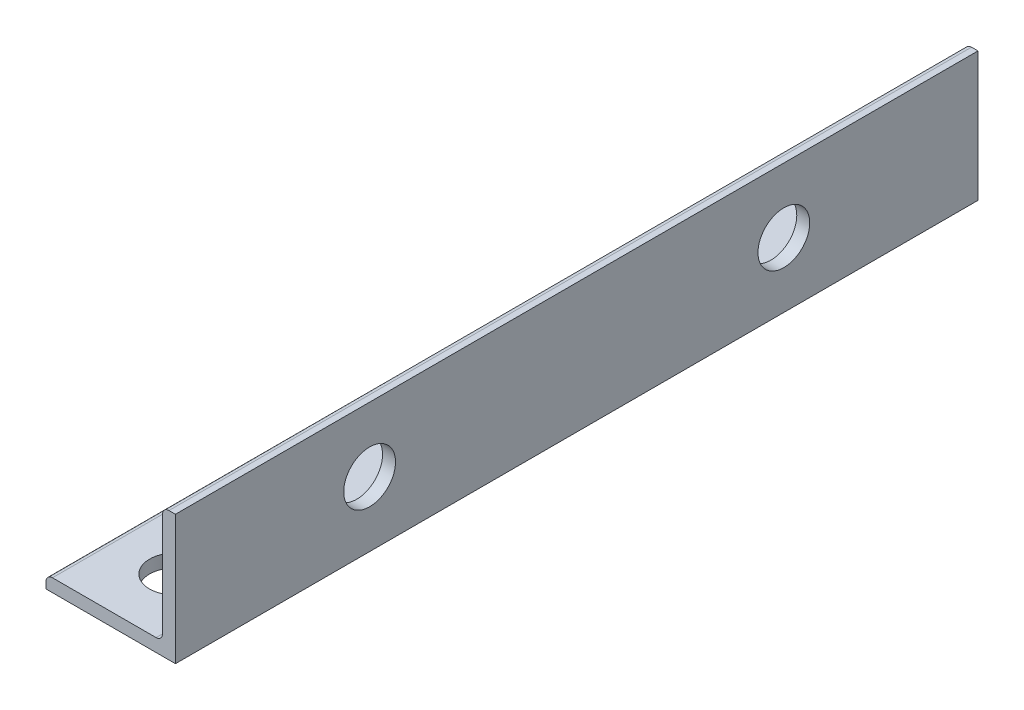
ISO-10303-21;
HEADER;
FILE_DESCRIPTION(('STEP AP214'),'2;1');
FILE_NAME('part.step','',(''),(''),'','','');
FILE_SCHEMA(('AUTOMOTIVE_DESIGN { 1 0 10303 214 1 1 1 1 }'));
ENDSEC;
DATA;
#1=APPLICATION_CONTEXT('core data for automotive mechanical design processes');
#2=APPLICATION_PROTOCOL_DEFINITION('international standard','automotive_design',2000,#1);
#3=PRODUCT_CONTEXT('',#1,'mechanical');
#4=PRODUCT('Part','Part','',(#3));
#5=PRODUCT_RELATED_PRODUCT_CATEGORY('part','',(#4));
#6=PRODUCT_DEFINITION_FORMATION('','',#4);
#7=PRODUCT_DEFINITION_CONTEXT('part definition',#1,'design');
#8=PRODUCT_DEFINITION('design','',#6,#7);
#9=PRODUCT_DEFINITION_SHAPE('','',#8);
#10=(LENGTH_UNIT() NAMED_UNIT(*) SI_UNIT(.MILLI.,.METRE.));
#11=(NAMED_UNIT(*) PLANE_ANGLE_UNIT() SI_UNIT($,.RADIAN.));
#12=(NAMED_UNIT(*) SI_UNIT($,.STERADIAN.) SOLID_ANGLE_UNIT());
#13=UNCERTAINTY_MEASURE_WITH_UNIT(LENGTH_MEASURE(1.E-05),#10,'distance_accuracy_value','');
#14=(GEOMETRIC_REPRESENTATION_CONTEXT(3) GLOBAL_UNCERTAINTY_ASSIGNED_CONTEXT((#13)) GLOBAL_UNIT_ASSIGNED_CONTEXT((#10,
#11,#12)) REPRESENTATION_CONTEXT('',''));
#15=CARTESIAN_POINT('',(0.,0.,0.));
#16=DIRECTION('',(0.,0.,1.));
#17=DIRECTION('',(1.,0.,0.));
#18=AXIS2_PLACEMENT_3D('',#15,#16,#17);
#19=CARTESIAN_POINT('',(-7.9375,0.793749999999998,49.2125));
#20=DIRECTION('',(1.,0.,0.));
#21=DIRECTION('',(0.,0.,-1.));
#22=AXIS2_PLACEMENT_3D('',#19,#20,#21);
#23=PLANE('',#22);
#24=DIRECTION('',(0.,-1.,0.));
#25=VECTOR('',#24,1.);
#26=CARTESIAN_POINT('',(-7.9375,0.793749999999998,-49.2125));
#27=LINE('',#26,#25);
#28=CARTESIAN_POINT('',(-7.9375,0.793749999999999,-49.2125));
#29=VERTEX_POINT('',#28);
#30=CARTESIAN_POINT('',(-7.9375,0.,-49.2125));
#31=VERTEX_POINT('',#30);
#32=EDGE_CURVE('E142',#29,#31,#27,.T.);
#33=ORIENTED_EDGE('',*,*,#32,.T.);
#34=DIRECTION('',(0.,0.,-1.));
#35=VECTOR('',#34,1.);
#36=CARTESIAN_POINT('',(-7.9375,0.,49.2125));
#37=LINE('',#36,#35);
#38=CARTESIAN_POINT('',(-7.9375,0.,49.2125));
#39=VERTEX_POINT('',#38);
#40=EDGE_CURVE('E11',#39,#31,#37,.T.);
#41=ORIENTED_EDGE('',*,*,#40,.F.);
#42=DIRECTION('',(0.,-1.,0.));
#43=VECTOR('',#42,1.);
#44=CARTESIAN_POINT('',(-7.9375,0.793749999999998,49.2125));
#45=LINE('',#44,#43);
#46=CARTESIAN_POINT('',(-7.9375,0.793749999999999,49.2125));
#47=VERTEX_POINT('',#46);
#48=EDGE_CURVE('E158',#47,#39,#45,.T.);
#49=ORIENTED_EDGE('',*,*,#48,.F.);
#50=DIRECTION('',(0.,0.,-1.));
#51=VECTOR('',#50,1.);
#52=CARTESIAN_POINT('',(-7.9375,0.793749999999999,49.2125));
#53=LINE('',#52,#51);
#54=EDGE_CURVE('E138',#47,#29,#53,.T.);
#55=ORIENTED_EDGE('',*,*,#54,.T.);
#56=EDGE_LOOP('',(#33,#41,#49,#55));
#57=FACE_BOUND('',#56,.T.);
#58=ADVANCED_FACE('F38',(#57),#23,.F.);
#59=CARTESIAN_POINT('',(-7.9375,0.,49.2125));
#60=DIRECTION('',(0.,1.,0.));
#61=DIRECTION('',(0.,0.,1.));
#62=AXIS2_PLACEMENT_3D('',#59,#60,#61);
#63=PLANE('',#62);
#64=CARTESIAN_POINT('',(0.,0.,-41.275));
#65=DIRECTION('',(0.,-1.,0.));
#66=DIRECTION('',(0.,0.,-1.));
#67=AXIS2_PLACEMENT_3D('',#64,#65,#66);
#68=CIRCLE('',#67,3.175);
#69=CARTESIAN_POINT('',(0.,0.,-44.45));
#70=VERTEX_POINT('',#69);
#71=EDGE_CURVE('E361',#70,#70,#68,.T.);
#72=ORIENTED_EDGE('',*,*,#71,.F.);
#73=EDGE_LOOP('',(#72));
#74=FACE_BOUND('',#73,.T.);
#75=CARTESIAN_POINT('',(0.,0.,41.275));
#76=DIRECTION('',(0.,-1.,0.));
#77=DIRECTION('',(0.,0.,-1.));
#78=AXIS2_PLACEMENT_3D('',#75,#76,#77);
#79=CIRCLE('',#78,3.175);
#80=CARTESIAN_POINT('',(0.,0.,38.1));
#81=VERTEX_POINT('',#80);
#82=EDGE_CURVE('E366',#81,#81,#79,.T.);
#83=ORIENTED_EDGE('',*,*,#82,.F.);
#84=EDGE_LOOP('',(#83));
#85=FACE_BOUND('',#84,.T.);
#86=DIRECTION('',(1.,0.,0.));
#87=VECTOR('',#86,1.);
#88=CARTESIAN_POINT('',(-7.9375,0.,-49.2125));
#89=LINE('',#88,#87);
#90=CARTESIAN_POINT('',(7.9375,0.,-49.2125));
#91=VERTEX_POINT('',#90);
#92=EDGE_CURVE('E145',#31,#91,#89,.T.);
#93=ORIENTED_EDGE('',*,*,#92,.T.);
#94=DIRECTION('',(0.,0.,-1.));
#95=VECTOR('',#94,1.);
#96=CARTESIAN_POINT('',(7.9375,0.,49.2125));
#97=LINE('',#96,#95);
#98=CARTESIAN_POINT('',(7.9375,0.,49.2125));
#99=VERTEX_POINT('',#98);
#100=EDGE_CURVE('E47',#99,#91,#97,.T.);
#101=ORIENTED_EDGE('',*,*,#100,.F.);
#102=DIRECTION('',(1.,0.,0.));
#103=VECTOR('',#102,1.);
#104=CARTESIAN_POINT('',(-7.9375,0.,49.2125));
#105=LINE('',#104,#103);
#106=EDGE_CURVE('E102',#39,#99,#105,.T.);
#107=ORIENTED_EDGE('',*,*,#106,.F.);
#108=ORIENTED_EDGE('',*,*,#40,.T.);
#109=EDGE_LOOP('',(#93,#101,#107,#108));
#110=FACE_BOUND('',#109,.T.);
#111=ADVANCED_FACE('F226',(#74,#85,#110),#63,.F.);
#112=CARTESIAN_POINT('',(7.9375,0.,49.2125));
#113=DIRECTION('',(-1.,0.,0.));
#114=DIRECTION('',(0.,0.,1.));
#115=AXIS2_PLACEMENT_3D('',#112,#113,#114);
#116=PLANE('',#115);
#117=CARTESIAN_POINT('',(7.9375,7.93749999999999,25.4));
#118=DIRECTION('',(1.,0.,0.));
#119=DIRECTION('',(0.,0.,-1.));
#120=AXIS2_PLACEMENT_3D('',#117,#118,#119);
#121=CIRCLE('',#120,3.175);
#122=CARTESIAN_POINT('',(7.9375,7.93749999999999,22.225));
#123=VERTEX_POINT('',#122);
#124=EDGE_CURVE('E174',#123,#123,#121,.T.);
#125=ORIENTED_EDGE('',*,*,#124,.F.);
#126=EDGE_LOOP('',(#125));
#127=FACE_BOUND('',#126,.T.);
#128=CARTESIAN_POINT('',(7.9375,7.93749999999999,-25.4));
#129=DIRECTION('',(1.,0.,0.));
#130=DIRECTION('',(0.,0.,-1.));
#131=AXIS2_PLACEMENT_3D('',#128,#129,#130);
#132=CIRCLE('',#131,3.175);
#133=CARTESIAN_POINT('',(7.9375,7.93749999999999,-28.575));
#134=VERTEX_POINT('',#133);
#135=EDGE_CURVE('E179',#134,#134,#132,.T.);
#136=ORIENTED_EDGE('',*,*,#135,.F.);
#137=EDGE_LOOP('',(#136));
#138=FACE_BOUND('',#137,.T.);
#139=DIRECTION('',(0.,1.,0.));
#140=VECTOR('',#139,1.);
#141=CARTESIAN_POINT('',(7.9375,0.,-49.2125));
#142=LINE('',#141,#140);
#143=CARTESIAN_POINT('',(7.9375,15.875,-49.2125));
#144=VERTEX_POINT('',#143);
#145=EDGE_CURVE('E147',#91,#144,#142,.T.);
#146=ORIENTED_EDGE('',*,*,#145,.T.);
#147=DIRECTION('',(0.,0.,-1.));
#148=VECTOR('',#147,1.);
#149=CARTESIAN_POINT('',(7.9375,15.875,49.2125));
#150=LINE('',#149,#148);
#151=CARTESIAN_POINT('',(7.9375,15.875,49.2125));
#152=VERTEX_POINT('',#151);
#153=EDGE_CURVE('E168',#152,#144,#150,.T.);
#154=ORIENTED_EDGE('',*,*,#153,.F.);
#155=DIRECTION('',(0.,1.,0.));
#156=VECTOR('',#155,1.);
#157=CARTESIAN_POINT('',(7.9375,0.,49.2125));
#158=LINE('',#157,#156);
#159=EDGE_CURVE('E192',#99,#152,#158,.T.);
#160=ORIENTED_EDGE('',*,*,#159,.F.);
#161=ORIENTED_EDGE('',*,*,#100,.T.);
#162=EDGE_LOOP('',(#146,#154,#160,#161));
#163=FACE_BOUND('',#162,.T.);
#164=ADVANCED_FACE('F230',(#127,#138,#163),#116,.F.);
#165=CARTESIAN_POINT('',(7.14375,15.875,49.2125));
#166=DIRECTION('',(0.,-1.,0.));
#167=DIRECTION('',(1.,0.,0.));
#168=AXIS2_PLACEMENT_3D('',#165,#166,#167);
#169=PLANE('',#168);
#170=DIRECTION('',(-1.,0.,0.));
#171=VECTOR('',#170,1.);
#172=CARTESIAN_POINT('',(7.14375,15.875,-49.2125));
#173=LINE('',#172,#171);
#174=CARTESIAN_POINT('',(7.14375,15.875,-49.2125));
#175=VERTEX_POINT('',#174);
#176=EDGE_CURVE('E149',#144,#175,#173,.T.);
#177=ORIENTED_EDGE('',*,*,#176,.T.);
#178=DIRECTION('',(0.,0.,-1.));
#179=VECTOR('',#178,1.);
#180=CARTESIAN_POINT('',(7.14375,15.875,49.2125));
#181=LINE('',#180,#179);
#182=CARTESIAN_POINT('',(7.14375,15.875,49.2125));
#183=VERTEX_POINT('',#182);
#184=EDGE_CURVE('E165',#183,#175,#181,.T.);
#185=ORIENTED_EDGE('',*,*,#184,.F.);
#186=DIRECTION('',(-1.,0.,0.));
#187=VECTOR('',#186,1.);
#188=CARTESIAN_POINT('',(7.14375,15.875,49.2125));
#189=LINE('',#188,#187);
#190=EDGE_CURVE('E194',#152,#183,#189,.T.);
#191=ORIENTED_EDGE('',*,*,#190,.F.);
#192=ORIENTED_EDGE('',*,*,#153,.T.);
#193=EDGE_LOOP('',(#177,#185,#191,#192));
#194=FACE_BOUND('',#193,.T.);
#195=ADVANCED_FACE('F235',(#194),#169,.F.);
#196=CARTESIAN_POINT('',(7.14375,15.08125,49.2125));
#197=DIRECTION('',(0.,0.,-1.));
#198=DIRECTION('',(-1.,0.,0.));
#199=AXIS2_PLACEMENT_3D('',#196,#197,#198);
#200=CYLINDRICAL_SURFACE('',#199,0.793749999999998);
#201=CARTESIAN_POINT('',(7.14375,15.08125,-49.2125));
#202=DIRECTION('',(0.,0.,1.));
#203=DIRECTION('',(-1.,0.,0.));
#204=AXIS2_PLACEMENT_3D('',#201,#202,#203);
#205=CIRCLE('',#204,0.793749999999998);
#206=CARTESIAN_POINT('',(6.35,15.08125,-49.2125));
#207=VERTEX_POINT('',#206);
#208=EDGE_CURVE('E151',#175,#207,#205,.T.);
#209=ORIENTED_EDGE('',*,*,#208,.T.);
#210=DIRECTION('',(0.,0.,-1.));
#211=VECTOR('',#210,1.);
#212=CARTESIAN_POINT('',(6.35,15.08125,49.2125));
#213=LINE('',#212,#211);
#214=CARTESIAN_POINT('',(6.35,15.08125,49.2125));
#215=VERTEX_POINT('',#214);
#216=EDGE_CURVE('E162',#215,#207,#213,.T.);
#217=ORIENTED_EDGE('',*,*,#216,.F.);
#218=CARTESIAN_POINT('',(7.14375,15.08125,49.2125));
#219=DIRECTION('',(0.,0.,1.));
#220=DIRECTION('',(-1.,0.,0.));
#221=AXIS2_PLACEMENT_3D('',#218,#219,#220);
#222=CIRCLE('',#221,0.793749999999998);
#223=EDGE_CURVE('E196',#183,#215,#222,.T.);
#224=ORIENTED_EDGE('',*,*,#223,.F.);
#225=ORIENTED_EDGE('',*,*,#184,.T.);
#226=EDGE_LOOP('',(#209,#217,#224,#225));
#227=FACE_BOUND('',#226,.T.);
#228=ADVANCED_FACE('F202',(#227),#200,.T.);
#229=CARTESIAN_POINT('',(6.35,15.08125,49.2125));
#230=DIRECTION('',(1.,0.,0.));
#231=DIRECTION('',(0.,1.,0.));
#232=AXIS2_PLACEMENT_3D('',#229,#230,#231);
#233=PLANE('',#232);
#234=CARTESIAN_POINT('',(6.35,7.93749999999999,25.4));
#235=DIRECTION('',(1.,0.,0.));
#236=DIRECTION('',(0.,1.,0.));
#237=AXIS2_PLACEMENT_3D('',#234,#235,#236);
#238=CIRCLE('',#237,3.175);
#239=CARTESIAN_POINT('',(6.35,11.1125,25.4));
#240=VERTEX_POINT('',#239);
#241=EDGE_CURVE('E41',#240,#240,#238,.T.);
#242=ORIENTED_EDGE('',*,*,#241,.T.);
#243=EDGE_LOOP('',(#242));
#244=FACE_BOUND('',#243,.T.);
#245=CARTESIAN_POINT('',(6.35,7.93749999999999,-25.4));
#246=DIRECTION('',(1.,0.,0.));
#247=DIRECTION('',(0.,1.,0.));
#248=AXIS2_PLACEMENT_3D('',#245,#246,#247);
#249=CIRCLE('',#248,3.175);
#250=CARTESIAN_POINT('',(6.35,11.1125,-25.4));
#251=VERTEX_POINT('',#250);
#252=EDGE_CURVE('E172',#251,#251,#249,.T.);
#253=ORIENTED_EDGE('',*,*,#252,.T.);
#254=EDGE_LOOP('',(#253));
#255=FACE_BOUND('',#254,.T.);
#256=DIRECTION('',(0.,-1.,0.));
#257=VECTOR('',#256,1.);
#258=CARTESIAN_POINT('',(6.35,15.08125,-49.2125));
#259=LINE('',#258,#257);
#260=CARTESIAN_POINT('',(6.35,2.38124999999999,-49.2125));
#261=VERTEX_POINT('',#260);
#262=EDGE_CURVE('E153',#207,#261,#259,.T.);
#263=ORIENTED_EDGE('',*,*,#262,.T.);
#264=DIRECTION('',(0.,0.,-1.));
#265=VECTOR('',#264,1.);
#266=CARTESIAN_POINT('',(6.35,2.38124999999999,49.2125));
#267=LINE('',#266,#265);
#268=CARTESIAN_POINT('',(6.35,2.38124999999999,49.2125));
#269=VERTEX_POINT('',#268);
#270=EDGE_CURVE('E133',#269,#261,#267,.T.);
#271=ORIENTED_EDGE('',*,*,#270,.F.);
#272=DIRECTION('',(0.,-1.,0.));
#273=VECTOR('',#272,1.);
#274=CARTESIAN_POINT('',(6.35,15.08125,49.2125));
#275=LINE('',#274,#273);
#276=EDGE_CURVE('E124',#215,#269,#275,.T.);
#277=ORIENTED_EDGE('',*,*,#276,.F.);
#278=ORIENTED_EDGE('',*,*,#216,.T.);
#279=EDGE_LOOP('',(#263,#271,#277,#278));
#280=FACE_BOUND('',#279,.T.);
#281=ADVANCED_FACE('F206',(#244,#255,#280),#233,.F.);
#282=CARTESIAN_POINT('',(5.55625000000001,2.38124999999999,49.2125));
#283=DIRECTION('',(0.,0.,-1.));
#284=DIRECTION('',(-1.,0.,0.));
#285=AXIS2_PLACEMENT_3D('',#282,#283,#284);
#286=CYLINDRICAL_SURFACE('',#285,0.793749999999998);
#287=CARTESIAN_POINT('',(5.55625000000001,2.38124999999999,-49.2125));
#288=DIRECTION('',(0.,0.,-1.));
#289=DIRECTION('',(-1.,0.,0.));
#290=AXIS2_PLACEMENT_3D('',#287,#288,#289);
#291=CIRCLE('',#290,0.793749999999998);
#292=CARTESIAN_POINT('',(5.55625000000001,1.5875,-49.2125));
#293=VERTEX_POINT('',#292);
#294=EDGE_CURVE('E132',#261,#293,#291,.T.);
#295=ORIENTED_EDGE('',*,*,#294,.T.);
#296=DIRECTION('',(0.,0.,-1.));
#297=VECTOR('',#296,1.);
#298=CARTESIAN_POINT('',(5.55625000000001,1.5875,49.2125));
#299=LINE('',#298,#297);
#300=CARTESIAN_POINT('',(5.55625000000001,1.5875,49.2125));
#301=VERTEX_POINT('',#300);
#302=EDGE_CURVE('E129',#301,#293,#299,.T.);
#303=ORIENTED_EDGE('',*,*,#302,.F.);
#304=CARTESIAN_POINT('',(5.55625000000001,2.38124999999999,49.2125));
#305=DIRECTION('',(0.,0.,-1.));
#306=DIRECTION('',(-1.,0.,0.));
#307=AXIS2_PLACEMENT_3D('',#304,#305,#306);
#308=CIRCLE('',#307,0.793749999999998);
#309=EDGE_CURVE('E118',#269,#301,#308,.T.);
#310=ORIENTED_EDGE('',*,*,#309,.F.);
#311=ORIENTED_EDGE('',*,*,#270,.T.);
#312=EDGE_LOOP('',(#295,#303,#310,#311));
#313=FACE_BOUND('',#312,.T.);
#314=ADVANCED_FACE('F130',(#313),#286,.F.);
#315=CARTESIAN_POINT('',(5.55625000000001,1.5875,49.2125));
#316=DIRECTION('',(0.,-1.,0.));
#317=DIRECTION('',(1.,0.,0.));
#318=AXIS2_PLACEMENT_3D('',#315,#316,#317);
#319=PLANE('',#318);
#320=CARTESIAN_POINT('',(0.,1.5875,-41.275));
#321=DIRECTION('',(0.,-1.,0.));
#322=DIRECTION('',(1.,0.,0.));
#323=AXIS2_PLACEMENT_3D('',#320,#321,#322);
#324=CIRCLE('',#323,3.175);
#325=CARTESIAN_POINT('',(3.175,1.5875,-41.275));
#326=VERTEX_POINT('',#325);
#327=EDGE_CURVE('E184',#326,#326,#324,.F.);
#328=ORIENTED_EDGE('',*,*,#327,.F.);
#329=EDGE_LOOP('',(#328));
#330=FACE_BOUND('',#329,.T.);
#331=CARTESIAN_POINT('',(0.,1.5875,41.275));
#332=DIRECTION('',(0.,-1.,0.));
#333=DIRECTION('',(1.,0.,0.));
#334=AXIS2_PLACEMENT_3D('',#331,#332,#333);
#335=CIRCLE('',#334,3.175);
#336=CARTESIAN_POINT('',(3.175,1.5875,41.275));
#337=VERTEX_POINT('',#336);
#338=EDGE_CURVE('E187',#337,#337,#335,.F.);
#339=ORIENTED_EDGE('',*,*,#338,.F.);
#340=EDGE_LOOP('',(#339));
#341=FACE_BOUND('',#340,.T.);
#342=DIRECTION('',(-1.,0.,0.));
#343=VECTOR('',#342,1.);
#344=CARTESIAN_POINT('',(5.55625000000001,1.5875,-49.2125));
#345=LINE('',#344,#343);
#346=CARTESIAN_POINT('',(-7.14375,1.5875,-49.2125));
#347=VERTEX_POINT('',#346);
#348=EDGE_CURVE('E88',#293,#347,#345,.T.);
#349=ORIENTED_EDGE('',*,*,#348,.T.);
#350=DIRECTION('',(0.,0.,-1.));
#351=VECTOR('',#350,1.);
#352=CARTESIAN_POINT('',(-7.14375,1.5875,49.2125));
#353=LINE('',#352,#351);
#354=CARTESIAN_POINT('',(-7.14375,1.5875,49.2125));
#355=VERTEX_POINT('',#354);
#356=EDGE_CURVE('E134',#355,#347,#353,.T.);
#357=ORIENTED_EDGE('',*,*,#356,.F.);
#358=DIRECTION('',(-1.,0.,0.));
#359=VECTOR('',#358,1.);
#360=CARTESIAN_POINT('',(5.55625000000001,1.5875,49.2125));
#361=LINE('',#360,#359);
#362=EDGE_CURVE('E122',#301,#355,#361,.T.);
#363=ORIENTED_EDGE('',*,*,#362,.F.);
#364=ORIENTED_EDGE('',*,*,#302,.T.);
#365=EDGE_LOOP('',(#349,#357,#363,#364));
#366=FACE_BOUND('',#365,.T.);
#367=ADVANCED_FACE('F136',(#330,#341,#366),#319,.F.);
#368=CARTESIAN_POINT('',(-7.14375,0.793749999999999,49.2125));
#369=DIRECTION('',(0.,0.,-1.));
#370=DIRECTION('',(-1.,0.,0.));
#371=AXIS2_PLACEMENT_3D('',#368,#369,#370);
#372=CYLINDRICAL_SURFACE('',#371,0.793749999999999);
#373=CARTESIAN_POINT('',(-7.14375,0.793749999999999,-49.2125));
#374=DIRECTION('',(0.,0.,1.));
#375=DIRECTION('',(-1.,0.,0.));
#376=AXIS2_PLACEMENT_3D('',#373,#374,#375);
#377=CIRCLE('',#376,0.793749999999999);
#378=EDGE_CURVE('E94',#347,#29,#377,.T.);
#379=ORIENTED_EDGE('',*,*,#378,.T.);
#380=ORIENTED_EDGE('',*,*,#54,.F.);
#381=CARTESIAN_POINT('',(-7.14375,0.793749999999999,49.2125));
#382=DIRECTION('',(0.,0.,1.));
#383=DIRECTION('',(-1.,0.,0.));
#384=AXIS2_PLACEMENT_3D('',#381,#382,#383);
#385=CIRCLE('',#384,0.793749999999999);
#386=EDGE_CURVE('E56',#355,#47,#385,.T.);
#387=ORIENTED_EDGE('',*,*,#386,.F.);
#388=ORIENTED_EDGE('',*,*,#356,.T.);
#389=EDGE_LOOP('',(#379,#380,#387,#388));
#390=FACE_BOUND('',#389,.T.);
#391=ADVANCED_FACE('F214',(#390),#372,.T.);
#392=CARTESIAN_POINT('',(7.14375,15.08125,49.2125));
#393=DIRECTION('',(0.,0.,-1.));
#394=DIRECTION('',(-1.,0.,0.));
#395=AXIS2_PLACEMENT_3D('',#392,#393,#394);
#396=PLANE('',#395);
#397=ORIENTED_EDGE('',*,*,#48,.T.);
#398=ORIENTED_EDGE('',*,*,#106,.T.);
#399=ORIENTED_EDGE('',*,*,#159,.T.);
#400=ORIENTED_EDGE('',*,*,#190,.T.);
#401=ORIENTED_EDGE('',*,*,#223,.T.);
#402=ORIENTED_EDGE('',*,*,#276,.T.);
#403=ORIENTED_EDGE('',*,*,#309,.T.);
#404=ORIENTED_EDGE('',*,*,#362,.T.);
#405=ORIENTED_EDGE('',*,*,#386,.T.);
#406=EDGE_LOOP('',(#397,#398,#399,#400,#401,#402,#403,#404,#405));
#407=FACE_BOUND('',#406,.T.);
#408=ADVANCED_FACE('F120',(#407),#396,.F.);
#409=CARTESIAN_POINT('',(7.14375,15.08125,-49.2125));
#410=DIRECTION('',(0.,0.,-1.));
#411=DIRECTION('',(-1.,0.,0.));
#412=AXIS2_PLACEMENT_3D('',#409,#410,#411);
#413=PLANE('',#412);
#414=ORIENTED_EDGE('',*,*,#32,.F.);
#415=ORIENTED_EDGE('',*,*,#378,.F.);
#416=ORIENTED_EDGE('',*,*,#348,.F.);
#417=ORIENTED_EDGE('',*,*,#294,.F.);
#418=ORIENTED_EDGE('',*,*,#262,.F.);
#419=ORIENTED_EDGE('',*,*,#208,.F.);
#420=ORIENTED_EDGE('',*,*,#176,.F.);
#421=ORIENTED_EDGE('',*,*,#145,.F.);
#422=ORIENTED_EDGE('',*,*,#92,.F.);
#423=EDGE_LOOP('',(#414,#415,#416,#417,#418,#419,#420,#421,#422));
#424=FACE_BOUND('',#423,.T.);
#425=ADVANCED_FACE('F209',(#424),#413,.T.);
#426=CARTESIAN_POINT('',(-7.9375,7.93749999999999,-25.4));
#427=DIRECTION('',(1.,0.,0.));
#428=DIRECTION('',(0.,0.,-1.));
#429=AXIS2_PLACEMENT_3D('',#426,#427,#428);
#430=CYLINDRICAL_SURFACE('',#429,3.175);
#431=ORIENTED_EDGE('',*,*,#135,.T.);
#432=EDGE_LOOP('',(#431));
#433=FACE_BOUND('',#432,.T.);
#434=ORIENTED_EDGE('',*,*,#252,.F.);
#435=EDGE_LOOP('',(#434));
#436=FACE_BOUND('',#435,.T.);
#437=ADVANCED_FACE('F294',(#433,#436),#430,.F.);
#438=CARTESIAN_POINT('',(-7.9375,7.93749999999999,25.4));
#439=DIRECTION('',(1.,0.,0.));
#440=DIRECTION('',(0.,0.,-1.));
#441=AXIS2_PLACEMENT_3D('',#438,#439,#440);
#442=CYLINDRICAL_SURFACE('',#441,3.175);
#443=ORIENTED_EDGE('',*,*,#124,.T.);
#444=EDGE_LOOP('',(#443));
#445=FACE_BOUND('',#444,.T.);
#446=ORIENTED_EDGE('',*,*,#241,.F.);
#447=EDGE_LOOP('',(#446));
#448=FACE_BOUND('',#447,.T.);
#449=ADVANCED_FACE('F274',(#445,#448),#442,.F.);
#450=CARTESIAN_POINT('',(0.,15.876,41.275));
#451=DIRECTION('',(0.,-1.,0.));
#452=DIRECTION('',(0.,0.,-1.));
#453=AXIS2_PLACEMENT_3D('',#450,#451,#452);
#454=CYLINDRICAL_SURFACE('',#453,3.175);
#455=ORIENTED_EDGE('',*,*,#82,.T.);
#456=EDGE_LOOP('',(#455));
#457=FACE_BOUND('',#456,.T.);
#458=ORIENTED_EDGE('',*,*,#338,.T.);
#459=EDGE_LOOP('',(#458));
#460=FACE_BOUND('',#459,.T.);
#461=ADVANCED_FACE('F268',(#457,#460),#454,.F.);
#462=CARTESIAN_POINT('',(0.,15.876,-41.275));
#463=DIRECTION('',(0.,-1.,0.));
#464=DIRECTION('',(0.,0.,-1.));
#465=AXIS2_PLACEMENT_3D('',#462,#463,#464);
#466=CYLINDRICAL_SURFACE('',#465,3.175);
#467=ORIENTED_EDGE('',*,*,#71,.T.);
#468=EDGE_LOOP('',(#467));
#469=FACE_BOUND('',#468,.T.);
#470=ORIENTED_EDGE('',*,*,#327,.T.);
#471=EDGE_LOOP('',(#470));
#472=FACE_BOUND('',#471,.T.);
#473=ADVANCED_FACE('F273',(#469,#472),#466,.F.);
#474=CLOSED_SHELL('',(#58,#111,#164,#195,#228,#281,#314,#367,#391,#408,#425,#437,#449,#461,#473));
#475=MANIFOLD_SOLID_BREP('B2',#474);
#476=ADVANCED_BREP_SHAPE_REPRESENTATION('',(#18,#475),#14);
#477=SHAPE_DEFINITION_REPRESENTATION(#9,#476);
ENDSEC;
END-ISO-10303-21;
